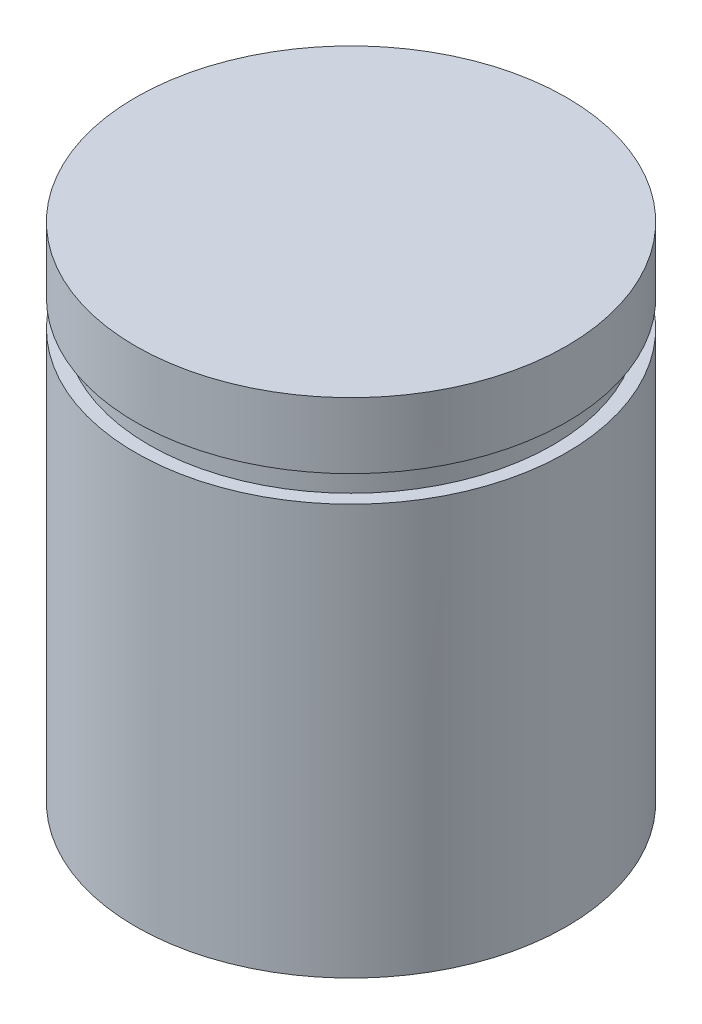
ISO-10303-21;
HEADER;
FILE_DESCRIPTION(('STEP AP214'),'2;1');
FILE_NAME('part.step','',(''),(''),'','','');
FILE_SCHEMA(('AUTOMOTIVE_DESIGN { 1 0 10303 214 1 1 1 1 }'));
ENDSEC;
DATA;
#1=APPLICATION_CONTEXT('core data for automotive mechanical design processes');
#2=APPLICATION_PROTOCOL_DEFINITION('international standard','automotive_design',2000,#1);
#3=PRODUCT_CONTEXT('',#1,'mechanical');
#4=PRODUCT('Part','Part','',(#3));
#5=PRODUCT_RELATED_PRODUCT_CATEGORY('part','',(#4));
#6=PRODUCT_DEFINITION_FORMATION('','',#4);
#7=PRODUCT_DEFINITION_CONTEXT('part definition',#1,'design');
#8=PRODUCT_DEFINITION('design','',#6,#7);
#9=PRODUCT_DEFINITION_SHAPE('','',#8);
#10=(LENGTH_UNIT() NAMED_UNIT(*) SI_UNIT(.MILLI.,.METRE.));
#11=(NAMED_UNIT(*) PLANE_ANGLE_UNIT() SI_UNIT($,.RADIAN.));
#12=(NAMED_UNIT(*) SI_UNIT($,.STERADIAN.) SOLID_ANGLE_UNIT());
#13=UNCERTAINTY_MEASURE_WITH_UNIT(LENGTH_MEASURE(1.E-05),#10,'distance_accuracy_value','');
#14=(GEOMETRIC_REPRESENTATION_CONTEXT(3) GLOBAL_UNCERTAINTY_ASSIGNED_CONTEXT((#13)) GLOBAL_UNIT_ASSIGNED_CONTEXT((#10,
#11,#12)) REPRESENTATION_CONTEXT('',''));
#15=CARTESIAN_POINT('',(0.,0.,0.));
#16=DIRECTION('',(0.,0.,1.));
#17=DIRECTION('',(1.,0.,0.));
#18=AXIS2_PLACEMENT_3D('',#15,#16,#17);
#19=CARTESIAN_POINT('',(0.,14.,0.));
#20=DIRECTION('',(0.,-1.,0.));
#21=DIRECTION('',(0.,0.,-1.));
#22=AXIS2_PLACEMENT_3D('',#19,#20,#21);
#23=CYLINDRICAL_SURFACE('',#22,6.);
#24=CARTESIAN_POINT('',(0.,14.,0.));
#25=DIRECTION('',(0.,1.,0.));
#26=DIRECTION('',(0.,0.,1.));
#27=AXIS2_PLACEMENT_3D('',#24,#25,#26);
#28=CIRCLE('',#27,6.);
#29=CARTESIAN_POINT('',(0.,14.,6.));
#30=VERTEX_POINT('',#29);
#31=EDGE_CURVE('E10',#30,#30,#28,.T.);
#32=ORIENTED_EDGE('',*,*,#31,.F.);
#33=EDGE_LOOP('',(#32));
#34=FACE_BOUND('',#33,.T.);
#35=CARTESIAN_POINT('',(0.,12.1666,0.));
#36=DIRECTION('',(0.,-1.,0.));
#37=DIRECTION('',(0.,0.,-1.));
#38=AXIS2_PLACEMENT_3D('',#35,#36,#37);
#39=CIRCLE('',#38,6.);
#40=CARTESIAN_POINT('',(0.,12.1666,-6.));
#41=VERTEX_POINT('',#40);
#42=EDGE_CURVE('E34',#41,#41,#39,.T.);
#43=ORIENTED_EDGE('',*,*,#42,.F.);
#44=EDGE_LOOP('',(#43));
#45=FACE_BOUND('',#44,.T.);
#46=ADVANCED_FACE('F30',(#34,#45),#23,.T.);
#47=CARTESIAN_POINT('',(0.,14.,0.));
#48=DIRECTION('',(0.,1.,0.));
#49=DIRECTION('',(0.,0.,1.));
#50=AXIS2_PLACEMENT_3D('',#47,#48,#49);
#51=PLANE('',#50);
#52=ORIENTED_EDGE('',*,*,#31,.T.);
#53=EDGE_LOOP('',(#52));
#54=FACE_BOUND('',#53,.T.);
#55=ADVANCED_FACE('F75',(#54),#51,.T.);
#56=CARTESIAN_POINT('',(0.,12.1666,0.));
#57=DIRECTION('',(0.,-1.,0.));
#58=DIRECTION('',(0.,0.,-1.));
#59=AXIS2_PLACEMENT_3D('',#56,#57,#58);
#60=PLANE('',#59);
#61=CARTESIAN_POINT('',(0.,12.1666,0.));
#62=DIRECTION('',(0.,-1.,0.));
#63=DIRECTION('',(0.,0.,-1.));
#64=AXIS2_PLACEMENT_3D('',#61,#62,#63);
#65=CIRCLE('',#64,5.6261);
#66=CARTESIAN_POINT('',(0.,12.1666,-5.6261));
#67=VERTEX_POINT('',#66);
#68=EDGE_CURVE('E49',#67,#67,#65,.T.);
#69=ORIENTED_EDGE('',*,*,#68,.F.);
#70=EDGE_LOOP('',(#69));
#71=FACE_BOUND('',#70,.T.);
#72=ORIENTED_EDGE('',*,*,#42,.T.);
#73=EDGE_LOOP('',(#72));
#74=FACE_BOUND('',#73,.T.);
#75=ADVANCED_FACE('F71',(#71,#74),#60,.T.);
#76=CARTESIAN_POINT('',(0.,11.43,0.));
#77=DIRECTION('',(0.,-1.,0.));
#78=DIRECTION('',(0.,0.,-1.));
#79=AXIS2_PLACEMENT_3D('',#76,#77,#78);
#80=PLANE('',#79);
#81=CARTESIAN_POINT('',(0.,11.43,0.));
#82=DIRECTION('',(0.,-1.,0.));
#83=DIRECTION('',(0.,0.,-1.));
#84=AXIS2_PLACEMENT_3D('',#81,#82,#83);
#85=CIRCLE('',#84,5.6261);
#86=CARTESIAN_POINT('',(0.,11.43,-5.6261));
#87=VERTEX_POINT('',#86);
#88=EDGE_CURVE('E45',#87,#87,#85,.T.);
#89=ORIENTED_EDGE('',*,*,#88,.T.);
#90=EDGE_LOOP('',(#89));
#91=FACE_BOUND('',#90,.T.);
#92=CARTESIAN_POINT('',(0.,11.43,0.));
#93=DIRECTION('',(0.,-1.,0.));
#94=DIRECTION('',(0.,0.,-1.));
#95=AXIS2_PLACEMENT_3D('',#92,#93,#94);
#96=CIRCLE('',#95,6.);
#97=CARTESIAN_POINT('',(0.,11.43,-6.));
#98=VERTEX_POINT('',#97);
#99=EDGE_CURVE('E47',#98,#98,#96,.T.);
#100=ORIENTED_EDGE('',*,*,#99,.F.);
#101=EDGE_LOOP('',(#100));
#102=FACE_BOUND('',#101,.T.);
#103=ADVANCED_FACE('F59',(#91,#102),#80,.F.);
#104=CARTESIAN_POINT('',(0.,12.1666,0.));
#105=DIRECTION('',(0.,-1.,0.));
#106=DIRECTION('',(0.,0.,-1.));
#107=AXIS2_PLACEMENT_3D('',#104,#105,#106);
#108=CYLINDRICAL_SURFACE('',#107,5.6261);
#109=ORIENTED_EDGE('',*,*,#68,.T.);
#110=EDGE_LOOP('',(#109));
#111=FACE_BOUND('',#110,.T.);
#112=ORIENTED_EDGE('',*,*,#88,.F.);
#113=EDGE_LOOP('',(#112));
#114=FACE_BOUND('',#113,.T.);
#115=ADVANCED_FACE('F62',(#111,#114),#108,.T.);
#116=CARTESIAN_POINT('',(0.,0.,0.));
#117=DIRECTION('',(0.,1.,0.));
#118=DIRECTION('',(0.,0.,1.));
#119=AXIS2_PLACEMENT_3D('',#116,#117,#118);
#120=PLANE('',#119);
#121=CARTESIAN_POINT('',(0.,0.,0.));
#122=DIRECTION('',(0.,1.,0.));
#123=DIRECTION('',(0.,0.,1.));
#124=AXIS2_PLACEMENT_3D('',#121,#122,#123);
#125=CIRCLE('',#124,6.);
#126=CARTESIAN_POINT('',(0.,0.,6.));
#127=VERTEX_POINT('',#126);
#128=EDGE_CURVE('E38',#127,#127,#125,.T.);
#129=ORIENTED_EDGE('',*,*,#128,.F.);
#130=EDGE_LOOP('',(#129));
#131=FACE_BOUND('',#130,.T.);
#132=ADVANCED_FACE('F64',(#131),#120,.F.);
#133=ORIENTED_EDGE('',*,*,#99,.T.);
#134=EDGE_LOOP('',(#133));
#135=FACE_BOUND('',#134,.T.);
#136=ORIENTED_EDGE('',*,*,#128,.T.);
#137=EDGE_LOOP('',(#136));
#138=FACE_BOUND('',#137,.T.);
#139=ADVANCED_FACE('F32',(#135,#138),#23,.T.);
#140=CLOSED_SHELL('',(#46,#55,#75,#103,#115,#132,#139));
#141=MANIFOLD_SOLID_BREP('B2',#140);
#142=ADVANCED_BREP_SHAPE_REPRESENTATION('',(#18,#141),#14);
#143=SHAPE_DEFINITION_REPRESENTATION(#9,#142);
ENDSEC;
END-ISO-10303-21;
